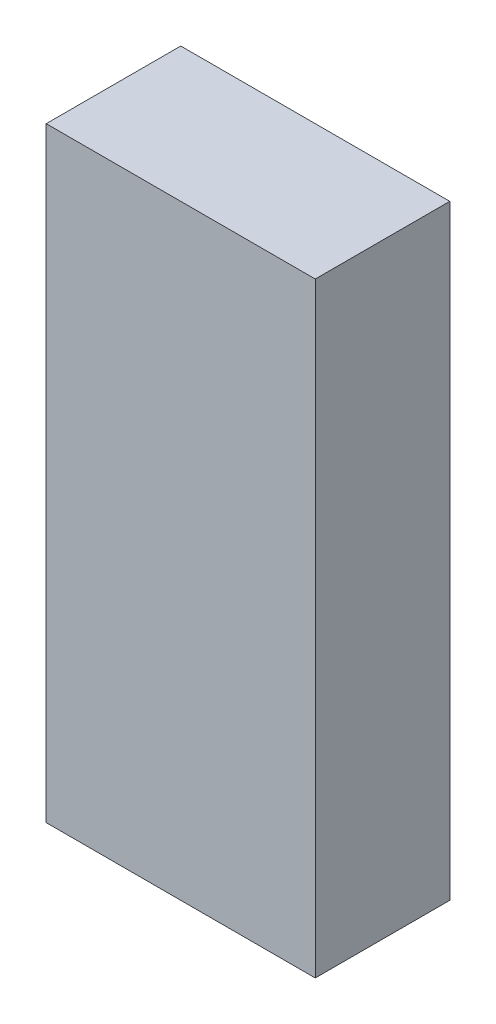
ISO-10303-21;
HEADER;
FILE_DESCRIPTION(('STEP AP214'),'2;1');
FILE_NAME('part.step','',(''),(''),'','','');
FILE_SCHEMA(('AUTOMOTIVE_DESIGN { 1 0 10303 214 1 1 1 1 }'));
ENDSEC;
DATA;
#1=APPLICATION_CONTEXT('core data for automotive mechanical design processes');
#2=APPLICATION_PROTOCOL_DEFINITION('international standard','automotive_design',2000,#1);
#3=PRODUCT_CONTEXT('',#1,'mechanical');
#4=PRODUCT('Part','Part','',(#3));
#5=PRODUCT_RELATED_PRODUCT_CATEGORY('part','',(#4));
#6=PRODUCT_DEFINITION_FORMATION('','',#4);
#7=PRODUCT_DEFINITION_CONTEXT('part definition',#1,'design');
#8=PRODUCT_DEFINITION('design','',#6,#7);
#9=PRODUCT_DEFINITION_SHAPE('','',#8);
#10=(LENGTH_UNIT() NAMED_UNIT(*) SI_UNIT(.MILLI.,.METRE.));
#11=(NAMED_UNIT(*) PLANE_ANGLE_UNIT() SI_UNIT($,.RADIAN.));
#12=(NAMED_UNIT(*) SI_UNIT($,.STERADIAN.) SOLID_ANGLE_UNIT());
#13=UNCERTAINTY_MEASURE_WITH_UNIT(LENGTH_MEASURE(1.E-05),#10,'distance_accuracy_value','');
#14=(GEOMETRIC_REPRESENTATION_CONTEXT(3) GLOBAL_UNCERTAINTY_ASSIGNED_CONTEXT((#13)) GLOBAL_UNIT_ASSIGNED_CONTEXT((#10,
#11,#12)) REPRESENTATION_CONTEXT('',''));
#15=CARTESIAN_POINT('',(0.,0.,0.));
#16=DIRECTION('',(0.,0.,1.));
#17=DIRECTION('',(1.,0.,0.));
#18=AXIS2_PLACEMENT_3D('',#15,#16,#17);
#19=CARTESIAN_POINT('',(0.9,-2.975,0.));
#20=DIRECTION('',(1.,0.,0.));
#21=DIRECTION('',(0.,0.,1.));
#22=AXIS2_PLACEMENT_3D('',#19,#20,#21);
#23=PLANE('',#22);
#24=DIRECTION('',(0.,1.,0.));
#25=VECTOR('',#24,1.);
#26=CARTESIAN_POINT('',(0.9,-2.975,0.1));
#27=LINE('',#26,#25);
#28=CARTESIAN_POINT('',(0.9,-2.975,0.1));
#29=VERTEX_POINT('',#28);
#30=CARTESIAN_POINT('',(0.9,-2.525,0.1));
#31=VERTEX_POINT('',#30);
#32=EDGE_CURVE('E11',#29,#31,#27,.T.);
#33=ORIENTED_EDGE('',*,*,#32,.T.);
#34=DIRECTION('',(0.,0.,1.));
#35=VECTOR('',#34,1.);
#36=CARTESIAN_POINT('',(0.9,-2.525,0.));
#37=LINE('',#36,#35);
#38=CARTESIAN_POINT('',(0.9,-2.525,0.));
#39=VERTEX_POINT('',#38);
#40=EDGE_CURVE('E24',#39,#31,#37,.T.);
#41=ORIENTED_EDGE('',*,*,#40,.F.);
#42=DIRECTION('',(0.,1.,0.));
#43=VECTOR('',#42,1.);
#44=CARTESIAN_POINT('',(0.9,-2.975,0.));
#45=LINE('',#44,#43);
#46=CARTESIAN_POINT('',(0.9,-2.975,0.));
#47=VERTEX_POINT('',#46);
#48=EDGE_CURVE('E86',#47,#39,#45,.T.);
#49=ORIENTED_EDGE('',*,*,#48,.F.);
#50=DIRECTION('',(0.,0.,1.));
#51=VECTOR('',#50,1.);
#52=CARTESIAN_POINT('',(0.9,-2.975,0.));
#53=LINE('',#52,#51);
#54=EDGE_CURVE('E36',#47,#29,#53,.T.);
#55=ORIENTED_EDGE('',*,*,#54,.T.);
#56=EDGE_LOOP('',(#33,#41,#49,#55));
#57=FACE_BOUND('',#56,.T.);
#58=ADVANCED_FACE('F17',(#57),#23,.F.);
#59=CARTESIAN_POINT('',(1.1,-2.975,0.));
#60=DIRECTION('',(1.,0.,0.));
#61=DIRECTION('',(0.,0.,1.));
#62=AXIS2_PLACEMENT_3D('',#59,#60,#61);
#63=PLANE('',#62);
#64=DIRECTION('',(0.,0.,1.));
#65=VECTOR('',#64,1.);
#66=CARTESIAN_POINT('',(1.1,-2.975,0.));
#67=LINE('',#66,#65);
#68=CARTESIAN_POINT('',(1.1,-2.975,0.));
#69=VERTEX_POINT('',#68);
#70=CARTESIAN_POINT('',(1.1,-2.975,0.1));
#71=VERTEX_POINT('',#70);
#72=EDGE_CURVE('E83',#69,#71,#67,.T.);
#73=ORIENTED_EDGE('',*,*,#72,.F.);
#74=DIRECTION('',(0.,1.,0.));
#75=VECTOR('',#74,1.);
#76=CARTESIAN_POINT('',(1.1,-2.975,0.));
#77=LINE('',#76,#75);
#78=CARTESIAN_POINT('',(1.1,-2.525,0.));
#79=VERTEX_POINT('',#78);
#80=EDGE_CURVE('E63',#69,#79,#77,.T.);
#81=ORIENTED_EDGE('',*,*,#80,.T.);
#82=DIRECTION('',(0.,0.,1.));
#83=VECTOR('',#82,1.);
#84=CARTESIAN_POINT('',(1.1,-2.525,0.));
#85=LINE('',#84,#83);
#86=CARTESIAN_POINT('',(1.1,-2.525,0.1));
#87=VERTEX_POINT('',#86);
#88=EDGE_CURVE('E57',#79,#87,#85,.T.);
#89=ORIENTED_EDGE('',*,*,#88,.T.);
#90=DIRECTION('',(0.,1.,0.));
#91=VECTOR('',#90,1.);
#92=CARTESIAN_POINT('',(1.1,-2.975,0.1));
#93=LINE('',#92,#91);
#94=EDGE_CURVE('E60',#71,#87,#93,.T.);
#95=ORIENTED_EDGE('',*,*,#94,.F.);
#96=EDGE_LOOP('',(#73,#81,#89,#95));
#97=FACE_BOUND('',#96,.T.);
#98=ADVANCED_FACE('F59',(#97),#63,.T.);
#99=CARTESIAN_POINT('',(0.9,-2.975,0.));
#100=DIRECTION('',(0.,1.,0.));
#101=DIRECTION('',(0.,0.,1.));
#102=AXIS2_PLACEMENT_3D('',#99,#100,#101);
#103=PLANE('',#102);
#104=ORIENTED_EDGE('',*,*,#72,.T.);
#105=DIRECTION('',(1.,0.,0.));
#106=VECTOR('',#105,1.);
#107=CARTESIAN_POINT('',(0.9,-2.975,0.1));
#108=LINE('',#107,#106);
#109=EDGE_CURVE('E71',#29,#71,#108,.T.);
#110=ORIENTED_EDGE('',*,*,#109,.F.);
#111=ORIENTED_EDGE('',*,*,#54,.F.);
#112=DIRECTION('',(1.,0.,0.));
#113=VECTOR('',#112,1.);
#114=CARTESIAN_POINT('',(0.9,-2.975,0.));
#115=LINE('',#114,#113);
#116=EDGE_CURVE('E76',#47,#69,#115,.T.);
#117=ORIENTED_EDGE('',*,*,#116,.T.);
#118=EDGE_LOOP('',(#104,#110,#111,#117));
#119=FACE_BOUND('',#118,.T.);
#120=ADVANCED_FACE('F91',(#119),#103,.F.);
#121=CARTESIAN_POINT('',(0.9,-2.525,0.));
#122=DIRECTION('',(0.,1.,0.));
#123=DIRECTION('',(0.,0.,1.));
#124=AXIS2_PLACEMENT_3D('',#121,#122,#123);
#125=PLANE('',#124);
#126=DIRECTION('',(1.,0.,0.));
#127=VECTOR('',#126,1.);
#128=CARTESIAN_POINT('',(0.9,-2.525,0.));
#129=LINE('',#128,#127);
#130=EDGE_CURVE('E74',#39,#79,#129,.T.);
#131=ORIENTED_EDGE('',*,*,#130,.F.);
#132=ORIENTED_EDGE('',*,*,#40,.T.);
#133=DIRECTION('',(1.,0.,0.));
#134=VECTOR('',#133,1.);
#135=CARTESIAN_POINT('',(0.9,-2.525,0.1));
#136=LINE('',#135,#134);
#137=EDGE_CURVE('E69',#31,#87,#136,.T.);
#138=ORIENTED_EDGE('',*,*,#137,.T.);
#139=ORIENTED_EDGE('',*,*,#88,.F.);
#140=EDGE_LOOP('',(#131,#132,#138,#139));
#141=FACE_BOUND('',#140,.T.);
#142=ADVANCED_FACE('F73',(#141),#125,.T.);
#143=CARTESIAN_POINT('',(0.9,-2.975,0.));
#144=DIRECTION('',(0.,0.,1.));
#145=DIRECTION('',(1.,0.,0.));
#146=AXIS2_PLACEMENT_3D('',#143,#144,#145);
#147=PLANE('',#146);
#148=ORIENTED_EDGE('',*,*,#130,.T.);
#149=ORIENTED_EDGE('',*,*,#80,.F.);
#150=ORIENTED_EDGE('',*,*,#116,.F.);
#151=ORIENTED_EDGE('',*,*,#48,.T.);
#152=EDGE_LOOP('',(#148,#149,#150,#151));
#153=FACE_BOUND('',#152,.T.);
#154=ADVANCED_FACE('F89',(#153),#147,.F.);
#155=CARTESIAN_POINT('',(0.9,-2.975,0.1));
#156=DIRECTION('',(0.,0.,1.));
#157=DIRECTION('',(1.,0.,0.));
#158=AXIS2_PLACEMENT_3D('',#155,#156,#157);
#159=PLANE('',#158);
#160=ORIENTED_EDGE('',*,*,#32,.F.);
#161=ORIENTED_EDGE('',*,*,#109,.T.);
#162=ORIENTED_EDGE('',*,*,#94,.T.);
#163=ORIENTED_EDGE('',*,*,#137,.F.);
#164=EDGE_LOOP('',(#160,#161,#162,#163));
#165=FACE_BOUND('',#164,.T.);
#166=ADVANCED_FACE('F68',(#165),#159,.T.);
#167=CLOSED_SHELL('',(#58,#98,#120,#142,#154,#166));
#168=MANIFOLD_SOLID_BREP('B1',#167);
#169=ADVANCED_BREP_SHAPE_REPRESENTATION('',(#18,#168),#14);
#170=SHAPE_DEFINITION_REPRESENTATION(#9,#169);
ENDSEC;
END-ISO-10303-21;
